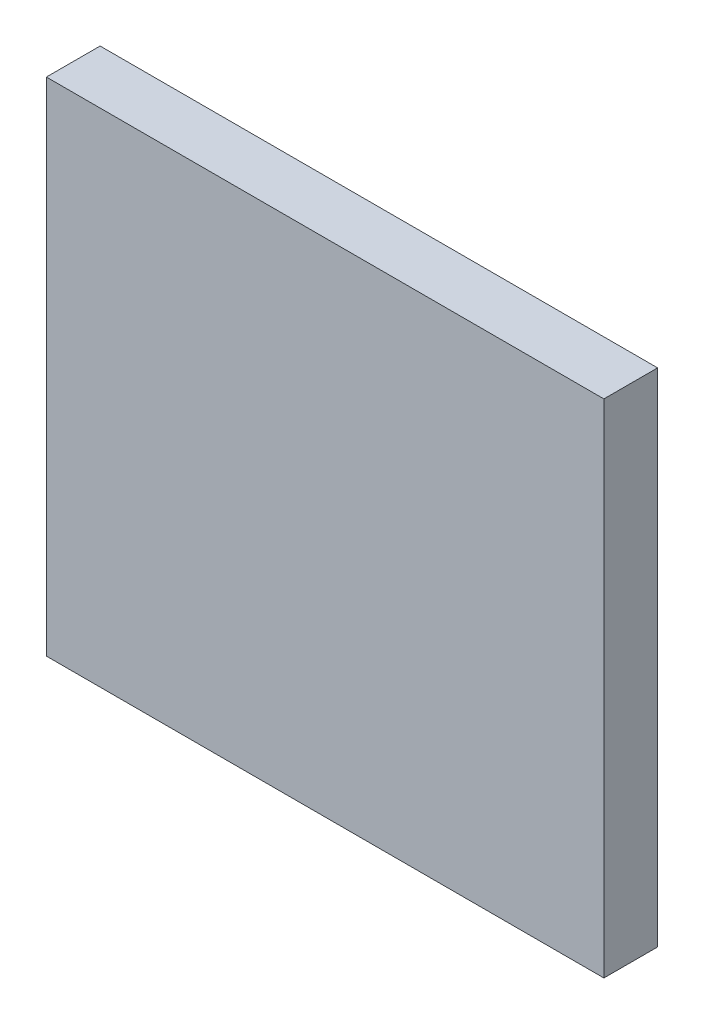
ISO-10303-21;
HEADER;
FILE_DESCRIPTION(('STEP AP214'),'2;1');
FILE_NAME('part.step','',(''),(''),'','','');
FILE_SCHEMA(('AUTOMOTIVE_DESIGN { 1 0 10303 214 1 1 1 1 }'));
ENDSEC;
DATA;
#1=APPLICATION_CONTEXT('core data for automotive mechanical design processes');
#2=APPLICATION_PROTOCOL_DEFINITION('international standard','automotive_design',2000,#1);
#3=PRODUCT_CONTEXT('',#1,'mechanical');
#4=PRODUCT('Part','Part','',(#3));
#5=PRODUCT_RELATED_PRODUCT_CATEGORY('part','',(#4));
#6=PRODUCT_DEFINITION_FORMATION('','',#4);
#7=PRODUCT_DEFINITION_CONTEXT('part definition',#1,'design');
#8=PRODUCT_DEFINITION('design','',#6,#7);
#9=PRODUCT_DEFINITION_SHAPE('','',#8);
#10=(LENGTH_UNIT() NAMED_UNIT(*) SI_UNIT(.MILLI.,.METRE.));
#11=(NAMED_UNIT(*) PLANE_ANGLE_UNIT() SI_UNIT($,.RADIAN.));
#12=(NAMED_UNIT(*) SI_UNIT($,.STERADIAN.) SOLID_ANGLE_UNIT());
#13=UNCERTAINTY_MEASURE_WITH_UNIT(LENGTH_MEASURE(1.E-05),#10,'distance_accuracy_value','');
#14=(GEOMETRIC_REPRESENTATION_CONTEXT(3) GLOBAL_UNCERTAINTY_ASSIGNED_CONTEXT((#13)) GLOBAL_UNIT_ASSIGNED_CONTEXT((#10,
#11,#12)) REPRESENTATION_CONTEXT('',''));
#15=CARTESIAN_POINT('',(0.,0.,0.));
#16=DIRECTION('',(0.,0.,1.));
#17=DIRECTION('',(1.,0.,0.));
#18=AXIS2_PLACEMENT_3D('',#15,#16,#17);
#19=CARTESIAN_POINT('',(0.,0.,12.));
#20=DIRECTION('',(-1.,0.,0.));
#21=DIRECTION('',(0.,-1.,0.));
#22=AXIS2_PLACEMENT_3D('',#19,#20,#21);
#23=PLANE('',#22);
#24=DIRECTION('',(0.,1.,0.));
#25=VECTOR('',#24,1.);
#26=CARTESIAN_POINT('',(0.,0.,0.));
#27=LINE('',#26,#25);
#28=CARTESIAN_POINT('',(0.,0.,0.));
#29=VERTEX_POINT('',#28);
#30=CARTESIAN_POINT('',(0.,112.,0.));
#31=VERTEX_POINT('',#30);
#32=EDGE_CURVE('E107',#29,#31,#27,.T.);
#33=ORIENTED_EDGE('',*,*,#32,.T.);
#34=DIRECTION('',(0.,0.,-1.));
#35=VECTOR('',#34,1.);
#36=CARTESIAN_POINT('',(0.,112.,12.));
#37=LINE('',#36,#35);
#38=CARTESIAN_POINT('',(0.,112.,12.));
#39=VERTEX_POINT('',#38);
#40=EDGE_CURVE('E11',#39,#31,#37,.T.);
#41=ORIENTED_EDGE('',*,*,#40,.F.);
#42=DIRECTION('',(0.,1.,0.));
#43=VECTOR('',#42,1.);
#44=CARTESIAN_POINT('',(0.,0.,12.));
#45=LINE('',#44,#43);
#46=CARTESIAN_POINT('',(0.,0.,12.));
#47=VERTEX_POINT('',#46);
#48=EDGE_CURVE('E91',#47,#39,#45,.T.);
#49=ORIENTED_EDGE('',*,*,#48,.F.);
#50=DIRECTION('',(0.,0.,-1.));
#51=VECTOR('',#50,1.);
#52=CARTESIAN_POINT('',(0.,0.,12.));
#53=LINE('',#52,#51);
#54=EDGE_CURVE('E103',#47,#29,#53,.T.);
#55=ORIENTED_EDGE('',*,*,#54,.T.);
#56=EDGE_LOOP('',(#33,#41,#49,#55));
#57=FACE_BOUND('',#56,.T.);
#58=ADVANCED_FACE('F39',(#57),#23,.F.);
#59=CARTESIAN_POINT('',(0.,112.,12.));
#60=DIRECTION('',(0.,-1.,0.));
#61=DIRECTION('',(1.,0.,0.));
#62=AXIS2_PLACEMENT_3D('',#59,#60,#61);
#63=PLANE('',#62);
#64=DIRECTION('',(-1.,0.,0.));
#65=VECTOR('',#64,1.);
#66=CARTESIAN_POINT('',(0.,112.,0.));
#67=LINE('',#66,#65);
#68=CARTESIAN_POINT('',(-124.5,112.,0.));
#69=VERTEX_POINT('',#68);
#70=EDGE_CURVE('E96',#31,#69,#67,.T.);
#71=ORIENTED_EDGE('',*,*,#70,.T.);
#72=DIRECTION('',(0.,0.,-1.));
#73=VECTOR('',#72,1.);
#74=CARTESIAN_POINT('',(-124.5,112.,12.));
#75=LINE('',#74,#73);
#76=CARTESIAN_POINT('',(-124.5,112.,12.));
#77=VERTEX_POINT('',#76);
#78=EDGE_CURVE('E48',#77,#69,#75,.T.);
#79=ORIENTED_EDGE('',*,*,#78,.F.);
#80=DIRECTION('',(-1.,0.,0.));
#81=VECTOR('',#80,1.);
#82=CARTESIAN_POINT('',(0.,112.,12.));
#83=LINE('',#82,#81);
#84=EDGE_CURVE('E86',#39,#77,#83,.T.);
#85=ORIENTED_EDGE('',*,*,#84,.F.);
#86=ORIENTED_EDGE('',*,*,#40,.T.);
#87=EDGE_LOOP('',(#71,#79,#85,#86));
#88=FACE_BOUND('',#87,.T.);
#89=ADVANCED_FACE('F95',(#88),#63,.F.);
#90=CARTESIAN_POINT('',(-124.5,0.,12.));
#91=DIRECTION('',(1.,0.,0.));
#92=DIRECTION('',(0.,0.,-1.));
#93=AXIS2_PLACEMENT_3D('',#90,#91,#92);
#94=PLANE('',#93);
#95=DIRECTION('',(0.,-1.,0.));
#96=VECTOR('',#95,1.);
#97=CARTESIAN_POINT('',(-124.5,0.,0.));
#98=LINE('',#97,#96);
#99=CARTESIAN_POINT('',(-124.5,0.,0.));
#100=VERTEX_POINT('',#99);
#101=EDGE_CURVE('E73',#69,#100,#98,.T.);
#102=ORIENTED_EDGE('',*,*,#101,.T.);
#103=DIRECTION('',(0.,0.,-1.));
#104=VECTOR('',#103,1.);
#105=CARTESIAN_POINT('',(-124.5,0.,12.));
#106=LINE('',#105,#104);
#107=CARTESIAN_POINT('',(-124.5,0.,12.));
#108=VERTEX_POINT('',#107);
#109=EDGE_CURVE('E98',#108,#100,#106,.T.);
#110=ORIENTED_EDGE('',*,*,#109,.F.);
#111=DIRECTION('',(0.,-1.,0.));
#112=VECTOR('',#111,1.);
#113=CARTESIAN_POINT('',(-124.5,0.,12.));
#114=LINE('',#113,#112);
#115=EDGE_CURVE('E89',#77,#108,#114,.T.);
#116=ORIENTED_EDGE('',*,*,#115,.F.);
#117=ORIENTED_EDGE('',*,*,#78,.T.);
#118=EDGE_LOOP('',(#102,#110,#116,#117));
#119=FACE_BOUND('',#118,.T.);
#120=ADVANCED_FACE('F99',(#119),#94,.F.);
#121=CARTESIAN_POINT('',(0.,0.,12.));
#122=DIRECTION('',(0.,1.,0.));
#123=DIRECTION('',(0.,0.,1.));
#124=AXIS2_PLACEMENT_3D('',#121,#122,#123);
#125=PLANE('',#124);
#126=DIRECTION('',(1.,0.,0.));
#127=VECTOR('',#126,1.);
#128=CARTESIAN_POINT('',(0.,0.,0.));
#129=LINE('',#128,#127);
#130=EDGE_CURVE('E79',#100,#29,#129,.T.);
#131=ORIENTED_EDGE('',*,*,#130,.T.);
#132=ORIENTED_EDGE('',*,*,#54,.F.);
#133=DIRECTION('',(1.,0.,0.));
#134=VECTOR('',#133,1.);
#135=CARTESIAN_POINT('',(0.,0.,12.));
#136=LINE('',#135,#134);
#137=EDGE_CURVE('E56',#108,#47,#136,.T.);
#138=ORIENTED_EDGE('',*,*,#137,.F.);
#139=ORIENTED_EDGE('',*,*,#109,.T.);
#140=EDGE_LOOP('',(#131,#132,#138,#139));
#141=FACE_BOUND('',#140,.T.);
#142=ADVANCED_FACE('F120',(#141),#125,.F.);
#143=CARTESIAN_POINT('',(0.,0.,12.));
#144=DIRECTION('',(0.,0.,1.));
#145=DIRECTION('',(1.,0.,0.));
#146=AXIS2_PLACEMENT_3D('',#143,#144,#145);
#147=PLANE('',#146);
#148=ORIENTED_EDGE('',*,*,#48,.T.);
#149=ORIENTED_EDGE('',*,*,#84,.T.);
#150=ORIENTED_EDGE('',*,*,#115,.T.);
#151=ORIENTED_EDGE('',*,*,#137,.T.);
#152=EDGE_LOOP('',(#148,#149,#150,#151));
#153=FACE_BOUND('',#152,.T.);
#154=ADVANCED_FACE('F87',(#153),#147,.T.);
#155=CARTESIAN_POINT('',(0.,0.,0.));
#156=DIRECTION('',(0.,0.,1.));
#157=DIRECTION('',(1.,0.,0.));
#158=AXIS2_PLACEMENT_3D('',#155,#156,#157);
#159=PLANE('',#158);
#160=ORIENTED_EDGE('',*,*,#32,.F.);
#161=ORIENTED_EDGE('',*,*,#130,.F.);
#162=ORIENTED_EDGE('',*,*,#101,.F.);
#163=ORIENTED_EDGE('',*,*,#70,.F.);
#164=EDGE_LOOP('',(#160,#161,#162,#163));
#165=FACE_BOUND('',#164,.T.);
#166=ADVANCED_FACE('F123',(#165),#159,.F.);
#167=CLOSED_SHELL('',(#58,#89,#120,#142,#154,#166));
#168=MANIFOLD_SOLID_BREP('B2',#167);
#169=ADVANCED_BREP_SHAPE_REPRESENTATION('',(#18,#168),#14);
#170=SHAPE_DEFINITION_REPRESENTATION(#9,#169);
ENDSEC;
END-ISO-10303-21;
